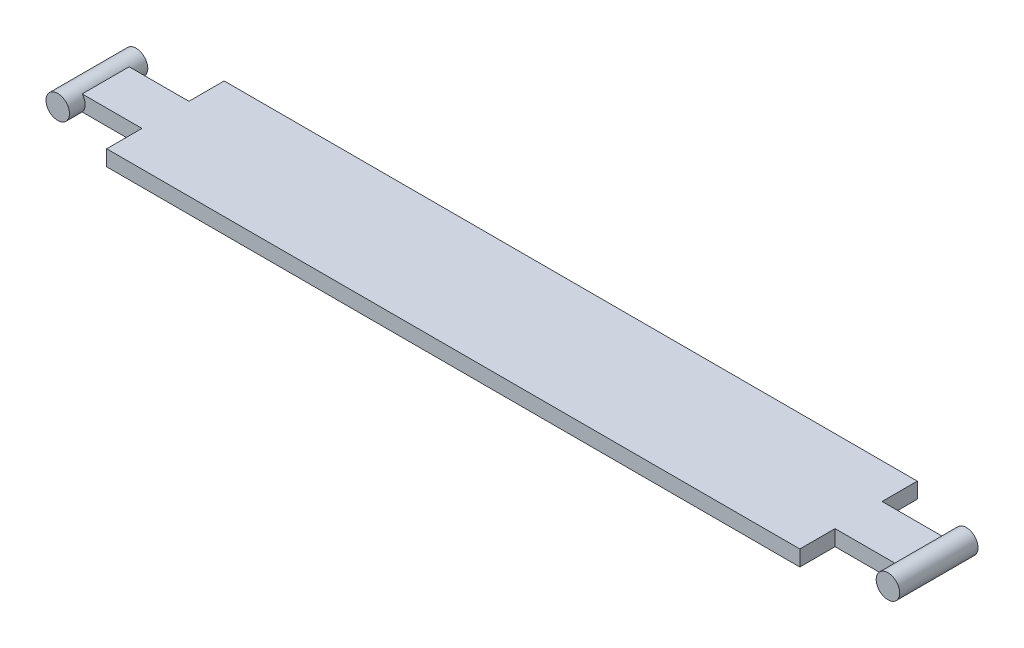
ISO-10303-21;
HEADER;
FILE_DESCRIPTION(('STEP AP214'),'2;1');
FILE_NAME('part.step','',(''),(''),'','','');
FILE_SCHEMA(('AUTOMOTIVE_DESIGN { 1 0 10303 214 1 1 1 1 }'));
ENDSEC;
DATA;
#1=APPLICATION_CONTEXT('core data for automotive mechanical design processes');
#2=APPLICATION_PROTOCOL_DEFINITION('international standard','automotive_design',2000,#1);
#3=PRODUCT_CONTEXT('',#1,'mechanical');
#4=PRODUCT('Part','Part','',(#3));
#5=PRODUCT_RELATED_PRODUCT_CATEGORY('part','',(#4));
#6=PRODUCT_DEFINITION_FORMATION('','',#4);
#7=PRODUCT_DEFINITION_CONTEXT('part definition',#1,'design');
#8=PRODUCT_DEFINITION('design','',#6,#7);
#9=PRODUCT_DEFINITION_SHAPE('','',#8);
#10=(LENGTH_UNIT() NAMED_UNIT(*) SI_UNIT(.MILLI.,.METRE.));
#11=(NAMED_UNIT(*) PLANE_ANGLE_UNIT() SI_UNIT($,.RADIAN.));
#12=(NAMED_UNIT(*) SI_UNIT($,.STERADIAN.) SOLID_ANGLE_UNIT());
#13=UNCERTAINTY_MEASURE_WITH_UNIT(LENGTH_MEASURE(1.E-05),#10,'distance_accuracy_value','');
#14=(GEOMETRIC_REPRESENTATION_CONTEXT(3) GLOBAL_UNCERTAINTY_ASSIGNED_CONTEXT((#13)) GLOBAL_UNIT_ASSIGNED_CONTEXT((#10,
#11,#12)) REPRESENTATION_CONTEXT('',''));
#15=CARTESIAN_POINT('',(0.,0.,0.));
#16=DIRECTION('',(0.,0.,1.));
#17=DIRECTION('',(1.,0.,0.));
#18=AXIS2_PLACEMENT_3D('',#15,#16,#17);
#19=CARTESIAN_POINT('',(0.,2.,0.));
#20=DIRECTION('',(0.,1.,0.));
#21=DIRECTION('',(0.,0.,1.));
#22=AXIS2_PLACEMENT_3D('',#19,#20,#21);
#23=PLANE('',#22);
#24=DIRECTION('',(1.,0.,0.));
#25=VECTOR('',#24,1.);
#26=CARTESIAN_POINT('',(53.,2.,2.99999999999999));
#27=LINE('',#26,#25);
#28=CARTESIAN_POINT('',(44.25,2.,2.99999999999999));
#29=VERTEX_POINT('',#28);
#30=CARTESIAN_POINT('',(51.8819660112501,2.,2.99999999999999));
#31=VERTEX_POINT('',#30);
#32=EDGE_CURVE('E132',#29,#31,#27,.T.);
#33=ORIENTED_EDGE('',*,*,#32,.T.);
#34=DIRECTION('',(0.,0.,-1.));
#35=VECTOR('',#34,1.);
#36=CARTESIAN_POINT('',(51.8819660112501,2.,5.));
#37=LINE('',#36,#35);
#38=CARTESIAN_POINT('',(51.8819660112501,2.,-2.99999999999999));
#39=VERTEX_POINT('',#38);
#40=EDGE_CURVE('E135',#31,#39,#37,.T.);
#41=ORIENTED_EDGE('',*,*,#40,.T.);
#42=DIRECTION('',(-1.,0.,0.));
#43=VECTOR('',#42,1.);
#44=CARTESIAN_POINT('',(53.,2.,-2.99999999999999));
#45=LINE('',#44,#43);
#46=CARTESIAN_POINT('',(44.25,2.,-2.99999999999999));
#47=VERTEX_POINT('',#46);
#48=EDGE_CURVE('E124',#39,#47,#45,.T.);
#49=ORIENTED_EDGE('',*,*,#48,.T.);
#50=DIRECTION('',(0.,0.,-1.));
#51=VECTOR('',#50,1.);
#52=CARTESIAN_POINT('',(44.25,2.,-7.49999999999999));
#53=LINE('',#52,#51);
#54=CARTESIAN_POINT('',(44.25,2.,-7.49999999999999));
#55=VERTEX_POINT('',#54);
#56=EDGE_CURVE('E131',#47,#55,#53,.T.);
#57=ORIENTED_EDGE('',*,*,#56,.T.);
#58=DIRECTION('',(-1.,0.,0.));
#59=VECTOR('',#58,1.);
#60=CARTESIAN_POINT('',(44.25,2.,-7.49999999999999));
#61=LINE('',#60,#59);
#62=CARTESIAN_POINT('',(-44.25,2.,-7.49999999999999));
#63=VERTEX_POINT('',#62);
#64=EDGE_CURVE('E168',#55,#63,#61,.T.);
#65=ORIENTED_EDGE('',*,*,#64,.T.);
#66=DIRECTION('',(0.,0.,1.));
#67=VECTOR('',#66,1.);
#68=CARTESIAN_POINT('',(-44.25,2.,-7.49999999999999));
#69=LINE('',#68,#67);
#70=CARTESIAN_POINT('',(-44.25,2.,-2.99999999999999));
#71=VERTEX_POINT('',#70);
#72=EDGE_CURVE('E170',#63,#71,#69,.T.);
#73=ORIENTED_EDGE('',*,*,#72,.T.);
#74=DIRECTION('',(-1.,0.,0.));
#75=VECTOR('',#74,1.);
#76=CARTESIAN_POINT('',(-53.,2.,-2.99999999999999));
#77=LINE('',#76,#75);
#78=CARTESIAN_POINT('',(-51.8819660112501,2.,-2.99999999999999));
#79=VERTEX_POINT('',#78);
#80=EDGE_CURVE('E172',#71,#79,#77,.T.);
#81=ORIENTED_EDGE('',*,*,#80,.T.);
#82=DIRECTION('',(0.,0.,-1.));
#83=VECTOR('',#82,1.);
#84=CARTESIAN_POINT('',(-51.8819660112501,2.,5.));
#85=LINE('',#84,#83);
#86=CARTESIAN_POINT('',(-51.8819660112501,2.,2.99999999999999));
#87=VERTEX_POINT('',#86);
#88=EDGE_CURVE('E160',#79,#87,#85,.F.);
#89=ORIENTED_EDGE('',*,*,#88,.T.);
#90=DIRECTION('',(1.,0.,0.));
#91=VECTOR('',#90,1.);
#92=CARTESIAN_POINT('',(-53.,2.,2.99999999999999));
#93=LINE('',#92,#91);
#94=CARTESIAN_POINT('',(-44.25,2.,2.99999999999999));
#95=VERTEX_POINT('',#94);
#96=EDGE_CURVE('E175',#87,#95,#93,.T.);
#97=ORIENTED_EDGE('',*,*,#96,.T.);
#98=DIRECTION('',(0.,0.,1.));
#99=VECTOR('',#98,1.);
#100=CARTESIAN_POINT('',(-44.25,2.,7.49999999999999));
#101=LINE('',#100,#99);
#102=CARTESIAN_POINT('',(-44.25,2.,7.49999999999999));
#103=VERTEX_POINT('',#102);
#104=EDGE_CURVE('E177',#95,#103,#101,.T.);
#105=ORIENTED_EDGE('',*,*,#104,.T.);
#106=DIRECTION('',(1.,0.,0.));
#107=VECTOR('',#106,1.);
#108=CARTESIAN_POINT('',(44.25,2.,7.49999999999999));
#109=LINE('',#108,#107);
#110=CARTESIAN_POINT('',(44.25,2.,7.49999999999999));
#111=VERTEX_POINT('',#110);
#112=EDGE_CURVE('E179',#103,#111,#109,.T.);
#113=ORIENTED_EDGE('',*,*,#112,.T.);
#114=DIRECTION('',(0.,0.,-1.));
#115=VECTOR('',#114,1.);
#116=CARTESIAN_POINT('',(44.25,2.,7.49999999999999));
#117=LINE('',#116,#115);
#118=EDGE_CURVE('E163',#111,#29,#117,.T.);
#119=ORIENTED_EDGE('',*,*,#118,.T.);
#120=EDGE_LOOP('',(#33,#41,#49,#57,#65,#73,#81,#89,#97,#105,#113,#119));
#121=FACE_BOUND('',#120,.T.);
#122=ADVANCED_FACE('F35',(#121),#23,.T.);
#123=CARTESIAN_POINT('',(0.,0.,0.));
#124=DIRECTION('',(0.,1.,0.));
#125=DIRECTION('',(0.,0.,1.));
#126=AXIS2_PLACEMENT_3D('',#123,#124,#125);
#127=PLANE('',#126);
#128=DIRECTION('',(0.,0.,-1.));
#129=VECTOR('',#128,1.);
#130=CARTESIAN_POINT('',(51.8819660112501,0.,5.));
#131=LINE('',#130,#129);
#132=CARTESIAN_POINT('',(51.8819660112501,0.,2.99999999999999));
#133=VERTEX_POINT('',#132);
#134=CARTESIAN_POINT('',(51.8819660112501,0.,-2.99999999999999));
#135=VERTEX_POINT('',#134);
#136=EDGE_CURVE('E58',#133,#135,#131,.T.);
#137=ORIENTED_EDGE('',*,*,#136,.F.);
#138=DIRECTION('',(1.,0.,0.));
#139=VECTOR('',#138,1.);
#140=CARTESIAN_POINT('',(53.,0.,2.99999999999999));
#141=LINE('',#140,#139);
#142=CARTESIAN_POINT('',(44.25,0.,2.99999999999999));
#143=VERTEX_POINT('',#142);
#144=EDGE_CURVE('E184',#143,#133,#141,.T.);
#145=ORIENTED_EDGE('',*,*,#144,.F.);
#146=DIRECTION('',(0.,0.,-1.));
#147=VECTOR('',#146,1.);
#148=CARTESIAN_POINT('',(44.25,0.,7.49999999999999));
#149=LINE('',#148,#147);
#150=CARTESIAN_POINT('',(44.25,0.,7.49999999999999));
#151=VERTEX_POINT('',#150);
#152=EDGE_CURVE('E162',#151,#143,#149,.T.);
#153=ORIENTED_EDGE('',*,*,#152,.F.);
#154=DIRECTION('',(1.,0.,0.));
#155=VECTOR('',#154,1.);
#156=CARTESIAN_POINT('',(44.25,0.,7.49999999999999));
#157=LINE('',#156,#155);
#158=CARTESIAN_POINT('',(-44.25,0.,7.49999999999999));
#159=VERTEX_POINT('',#158);
#160=EDGE_CURVE('E165',#159,#151,#157,.T.);
#161=ORIENTED_EDGE('',*,*,#160,.F.);
#162=DIRECTION('',(0.,0.,1.));
#163=VECTOR('',#162,1.);
#164=CARTESIAN_POINT('',(-44.25,0.,7.49999999999999));
#165=LINE('',#164,#163);
#166=CARTESIAN_POINT('',(-44.25,0.,2.99999999999999));
#167=VERTEX_POINT('',#166);
#168=EDGE_CURVE('E199',#167,#159,#165,.T.);
#169=ORIENTED_EDGE('',*,*,#168,.F.);
#170=DIRECTION('',(1.,0.,0.));
#171=VECTOR('',#170,1.);
#172=CARTESIAN_POINT('',(-53.,0.,2.99999999999999));
#173=LINE('',#172,#171);
#174=CARTESIAN_POINT('',(-51.8819660112501,0.,2.99999999999999));
#175=VERTEX_POINT('',#174);
#176=EDGE_CURVE('E197',#175,#167,#173,.T.);
#177=ORIENTED_EDGE('',*,*,#176,.F.);
#178=DIRECTION('',(0.,0.,-1.));
#179=VECTOR('',#178,1.);
#180=CARTESIAN_POINT('',(-51.8819660112501,0.,5.));
#181=LINE('',#180,#179);
#182=CARTESIAN_POINT('',(-51.8819660112501,0.,-2.99999999999999));
#183=VERTEX_POINT('',#182);
#184=EDGE_CURVE('E43',#183,#175,#181,.F.);
#185=ORIENTED_EDGE('',*,*,#184,.F.);
#186=DIRECTION('',(-1.,0.,0.));
#187=VECTOR('',#186,1.);
#188=CARTESIAN_POINT('',(-53.,0.,-2.99999999999999));
#189=LINE('',#188,#187);
#190=CARTESIAN_POINT('',(-44.25,0.,-2.99999999999999));
#191=VERTEX_POINT('',#190);
#192=EDGE_CURVE('E194',#191,#183,#189,.T.);
#193=ORIENTED_EDGE('',*,*,#192,.F.);
#194=DIRECTION('',(0.,0.,1.));
#195=VECTOR('',#194,1.);
#196=CARTESIAN_POINT('',(-44.25,0.,-7.49999999999999));
#197=LINE('',#196,#195);
#198=CARTESIAN_POINT('',(-44.25,0.,-7.49999999999999));
#199=VERTEX_POINT('',#198);
#200=EDGE_CURVE('E192',#199,#191,#197,.T.);
#201=ORIENTED_EDGE('',*,*,#200,.F.);
#202=DIRECTION('',(-1.,0.,0.));
#203=VECTOR('',#202,1.);
#204=CARTESIAN_POINT('',(44.25,0.,-7.49999999999999));
#205=LINE('',#204,#203);
#206=CARTESIAN_POINT('',(44.25,0.,-7.49999999999999));
#207=VERTEX_POINT('',#206);
#208=EDGE_CURVE('E190',#207,#199,#205,.T.);
#209=ORIENTED_EDGE('',*,*,#208,.F.);
#210=DIRECTION('',(0.,0.,-1.));
#211=VECTOR('',#210,1.);
#212=CARTESIAN_POINT('',(44.25,0.,-7.49999999999999));
#213=LINE('',#212,#211);
#214=CARTESIAN_POINT('',(44.25,0.,-2.99999999999999));
#215=VERTEX_POINT('',#214);
#216=EDGE_CURVE('E188',#215,#207,#213,.T.);
#217=ORIENTED_EDGE('',*,*,#216,.F.);
#218=DIRECTION('',(-1.,0.,0.));
#219=VECTOR('',#218,1.);
#220=CARTESIAN_POINT('',(53.,0.,-2.99999999999999));
#221=LINE('',#220,#219);
#222=EDGE_CURVE('E186',#135,#215,#221,.T.);
#223=ORIENTED_EDGE('',*,*,#222,.F.);
#224=EDGE_LOOP('',(#137,#145,#153,#161,#169,#177,#185,#193,#201,#209,#217,#223));
#225=FACE_BOUND('',#224,.T.);
#226=ADVANCED_FACE('F229',(#225),#127,.F.);
#227=CARTESIAN_POINT('',(44.25,2.,7.49999999999999));
#228=DIRECTION('',(-1.,0.,0.));
#229=DIRECTION('',(0.,0.,1.));
#230=AXIS2_PLACEMENT_3D('',#227,#228,#229);
#231=PLANE('',#230);
#232=ORIENTED_EDGE('',*,*,#152,.T.);
#233=DIRECTION('',(0.,-1.,0.));
#234=VECTOR('',#233,1.);
#235=CARTESIAN_POINT('',(44.25,2.,2.99999999999999));
#236=LINE('',#235,#234);
#237=EDGE_CURVE('E220',#29,#143,#236,.T.);
#238=ORIENTED_EDGE('',*,*,#237,.F.);
#239=ORIENTED_EDGE('',*,*,#118,.F.);
#240=DIRECTION('',(0.,-1.,0.));
#241=VECTOR('',#240,1.);
#242=CARTESIAN_POINT('',(44.25,2.,7.49999999999999));
#243=LINE('',#242,#241);
#244=EDGE_CURVE('E181',#111,#151,#243,.T.);
#245=ORIENTED_EDGE('',*,*,#244,.T.);
#246=EDGE_LOOP('',(#232,#238,#239,#245));
#247=FACE_BOUND('',#246,.T.);
#248=ADVANCED_FACE('F37',(#247),#231,.F.);
#249=CARTESIAN_POINT('',(53.,2.,2.99999999999999));
#250=DIRECTION('',(0.,0.,-1.));
#251=DIRECTION('',(-1.,0.,0.));
#252=AXIS2_PLACEMENT_3D('',#249,#250,#251);
#253=PLANE('',#252);
#254=CARTESIAN_POINT('',(53.,1.,2.99999999999999));
#255=DIRECTION('',(0.,0.,-1.));
#256=DIRECTION('',(-1.,0.,0.));
#257=AXIS2_PLACEMENT_3D('',#254,#255,#256);
#258=CIRCLE('',#257,1.5);
#259=EDGE_CURVE('E50',#31,#133,#258,.F.);
#260=ORIENTED_EDGE('',*,*,#259,.F.);
#261=ORIENTED_EDGE('',*,*,#32,.F.);
#262=ORIENTED_EDGE('',*,*,#237,.T.);
#263=ORIENTED_EDGE('',*,*,#144,.T.);
#264=EDGE_LOOP('',(#260,#261,#262,#263));
#265=FACE_BOUND('',#264,.T.);
#266=ADVANCED_FACE('F265',(#265),#253,.F.);
#267=CARTESIAN_POINT('',(53.,2.,-2.99999999999999));
#268=DIRECTION('',(0.,0.,1.));
#269=DIRECTION('',(1.,0.,0.));
#270=AXIS2_PLACEMENT_3D('',#267,#268,#269);
#271=PLANE('',#270);
#272=CARTESIAN_POINT('',(53.,1.,-2.99999999999999));
#273=DIRECTION('',(0.,0.,1.));
#274=DIRECTION('',(1.,0.,0.));
#275=AXIS2_PLACEMENT_3D('',#272,#273,#274);
#276=CIRCLE('',#275,1.5);
#277=EDGE_CURVE('E11',#135,#39,#276,.F.);
#278=ORIENTED_EDGE('',*,*,#277,.F.);
#279=ORIENTED_EDGE('',*,*,#222,.T.);
#280=DIRECTION('',(0.,-1.,0.));
#281=VECTOR('',#280,1.);
#282=CARTESIAN_POINT('',(44.25,2.,-2.99999999999999));
#283=LINE('',#282,#281);
#284=EDGE_CURVE('E128',#47,#215,#283,.T.);
#285=ORIENTED_EDGE('',*,*,#284,.F.);
#286=ORIENTED_EDGE('',*,*,#48,.F.);
#287=EDGE_LOOP('',(#278,#279,#285,#286));
#288=FACE_BOUND('',#287,.T.);
#289=ADVANCED_FACE('F126',(#288),#271,.F.);
#290=CARTESIAN_POINT('',(44.25,2.,-7.49999999999999));
#291=DIRECTION('',(-1.,0.,0.));
#292=DIRECTION('',(0.,0.,1.));
#293=AXIS2_PLACEMENT_3D('',#290,#291,#292);
#294=PLANE('',#293);
#295=ORIENTED_EDGE('',*,*,#216,.T.);
#296=DIRECTION('',(0.,-1.,0.));
#297=VECTOR('',#296,1.);
#298=CARTESIAN_POINT('',(44.25,2.,-7.49999999999999));
#299=LINE('',#298,#297);
#300=EDGE_CURVE('E216',#55,#207,#299,.T.);
#301=ORIENTED_EDGE('',*,*,#300,.F.);
#302=ORIENTED_EDGE('',*,*,#56,.F.);
#303=ORIENTED_EDGE('',*,*,#284,.T.);
#304=EDGE_LOOP('',(#295,#301,#302,#303));
#305=FACE_BOUND('',#304,.T.);
#306=ADVANCED_FACE('F247',(#305),#294,.F.);
#307=CARTESIAN_POINT('',(44.25,2.,-7.49999999999999));
#308=DIRECTION('',(0.,0.,1.));
#309=DIRECTION('',(1.,0.,0.));
#310=AXIS2_PLACEMENT_3D('',#307,#308,#309);
#311=PLANE('',#310);
#312=ORIENTED_EDGE('',*,*,#208,.T.);
#313=DIRECTION('',(0.,-1.,0.));
#314=VECTOR('',#313,1.);
#315=CARTESIAN_POINT('',(-44.25,2.,-7.49999999999999));
#316=LINE('',#315,#314);
#317=EDGE_CURVE('E213',#63,#199,#316,.T.);
#318=ORIENTED_EDGE('',*,*,#317,.F.);
#319=ORIENTED_EDGE('',*,*,#64,.F.);
#320=ORIENTED_EDGE('',*,*,#300,.T.);
#321=EDGE_LOOP('',(#312,#318,#319,#320));
#322=FACE_BOUND('',#321,.T.);
#323=ADVANCED_FACE('F243',(#322),#311,.F.);
#324=CARTESIAN_POINT('',(-44.25,2.,-7.49999999999999));
#325=DIRECTION('',(1.,0.,0.));
#326=DIRECTION('',(0.,0.,-1.));
#327=AXIS2_PLACEMENT_3D('',#324,#325,#326);
#328=PLANE('',#327);
#329=ORIENTED_EDGE('',*,*,#200,.T.);
#330=DIRECTION('',(0.,-1.,0.));
#331=VECTOR('',#330,1.);
#332=CARTESIAN_POINT('',(-44.25,2.,-2.99999999999999));
#333=LINE('',#332,#331);
#334=EDGE_CURVE('E210',#71,#191,#333,.T.);
#335=ORIENTED_EDGE('',*,*,#334,.F.);
#336=ORIENTED_EDGE('',*,*,#72,.F.);
#337=ORIENTED_EDGE('',*,*,#317,.T.);
#338=EDGE_LOOP('',(#329,#335,#336,#337));
#339=FACE_BOUND('',#338,.T.);
#340=ADVANCED_FACE('F238',(#339),#328,.F.);
#341=CARTESIAN_POINT('',(-53.,2.,-2.99999999999999));
#342=DIRECTION('',(0.,0.,1.));
#343=DIRECTION('',(1.,0.,0.));
#344=AXIS2_PLACEMENT_3D('',#341,#342,#343);
#345=PLANE('',#344);
#346=CARTESIAN_POINT('',(-53.,1.,-2.99999999999999));
#347=DIRECTION('',(0.,0.,1.));
#348=DIRECTION('',(1.,0.,0.));
#349=AXIS2_PLACEMENT_3D('',#346,#347,#348);
#350=CIRCLE('',#349,1.5);
#351=EDGE_CURVE('E157',#79,#183,#350,.F.);
#352=ORIENTED_EDGE('',*,*,#351,.F.);
#353=ORIENTED_EDGE('',*,*,#80,.F.);
#354=ORIENTED_EDGE('',*,*,#334,.T.);
#355=ORIENTED_EDGE('',*,*,#192,.T.);
#356=EDGE_LOOP('',(#352,#353,#354,#355));
#357=FACE_BOUND('',#356,.T.);
#358=ADVANCED_FACE('F233',(#357),#345,.F.);
#359=CARTESIAN_POINT('',(-53.,2.,2.99999999999999));
#360=DIRECTION('',(0.,0.,-1.));
#361=DIRECTION('',(-1.,0.,0.));
#362=AXIS2_PLACEMENT_3D('',#359,#360,#361);
#363=PLANE('',#362);
#364=CARTESIAN_POINT('',(-53.,1.,2.99999999999999));
#365=DIRECTION('',(0.,0.,-1.));
#366=DIRECTION('',(-1.,0.,0.));
#367=AXIS2_PLACEMENT_3D('',#364,#365,#366);
#368=CIRCLE('',#367,1.5);
#369=EDGE_CURVE('E152',#175,#87,#368,.F.);
#370=ORIENTED_EDGE('',*,*,#369,.F.);
#371=ORIENTED_EDGE('',*,*,#176,.T.);
#372=DIRECTION('',(0.,-1.,0.));
#373=VECTOR('',#372,1.);
#374=CARTESIAN_POINT('',(-44.25,2.,2.99999999999999));
#375=LINE('',#374,#373);
#376=EDGE_CURVE('E207',#95,#167,#375,.T.);
#377=ORIENTED_EDGE('',*,*,#376,.F.);
#378=ORIENTED_EDGE('',*,*,#96,.F.);
#379=EDGE_LOOP('',(#370,#371,#377,#378));
#380=FACE_BOUND('',#379,.T.);
#381=ADVANCED_FACE('F251',(#380),#363,.F.);
#382=CARTESIAN_POINT('',(-44.25,2.,7.49999999999999));
#383=DIRECTION('',(1.,0.,0.));
#384=DIRECTION('',(0.,0.,-1.));
#385=AXIS2_PLACEMENT_3D('',#382,#383,#384);
#386=PLANE('',#385);
#387=ORIENTED_EDGE('',*,*,#168,.T.);
#388=DIRECTION('',(0.,-1.,0.));
#389=VECTOR('',#388,1.);
#390=CARTESIAN_POINT('',(-44.25,2.,7.49999999999999));
#391=LINE('',#390,#389);
#392=EDGE_CURVE('E204',#103,#159,#391,.T.);
#393=ORIENTED_EDGE('',*,*,#392,.F.);
#394=ORIENTED_EDGE('',*,*,#104,.F.);
#395=ORIENTED_EDGE('',*,*,#376,.T.);
#396=EDGE_LOOP('',(#387,#393,#394,#395));
#397=FACE_BOUND('',#396,.T.);
#398=ADVANCED_FACE('F255',(#397),#386,.F.);
#399=CARTESIAN_POINT('',(44.25,2.,7.49999999999999));
#400=DIRECTION('',(0.,0.,-1.));
#401=DIRECTION('',(-1.,0.,0.));
#402=AXIS2_PLACEMENT_3D('',#399,#400,#401);
#403=PLANE('',#402);
#404=ORIENTED_EDGE('',*,*,#160,.T.);
#405=ORIENTED_EDGE('',*,*,#244,.F.);
#406=ORIENTED_EDGE('',*,*,#112,.F.);
#407=ORIENTED_EDGE('',*,*,#392,.T.);
#408=EDGE_LOOP('',(#404,#405,#406,#407));
#409=FACE_BOUND('',#408,.T.);
#410=ADVANCED_FACE('F261',(#409),#403,.F.);
#411=CARTESIAN_POINT('',(-53.,1.,5.));
#412=DIRECTION('',(0.,0.,-1.));
#413=DIRECTION('',(-1.,0.,0.));
#414=AXIS2_PLACEMENT_3D('',#411,#412,#413);
#415=CYLINDRICAL_SURFACE('',#414,1.5);
#416=ORIENTED_EDGE('',*,*,#88,.F.);
#417=ORIENTED_EDGE('',*,*,#351,.T.);
#418=ORIENTED_EDGE('',*,*,#184,.T.);
#419=ORIENTED_EDGE('',*,*,#369,.T.);
#420=EDGE_LOOP('',(#416,#417,#418,#419));
#421=FACE_BOUND('',#420,.T.);
#422=CARTESIAN_POINT('',(-53.,1.,5.));
#423=DIRECTION('',(0.,0.,1.));
#424=DIRECTION('',(1.,0.,0.));
#425=AXIS2_PLACEMENT_3D('',#422,#423,#424);
#426=CIRCLE('',#425,1.5);
#427=CARTESIAN_POINT('',(-51.5,1.,5.));
#428=VERTEX_POINT('',#427);
#429=EDGE_CURVE('E149',#428,#428,#426,.T.);
#430=ORIENTED_EDGE('',*,*,#429,.F.);
#431=EDGE_LOOP('',(#430));
#432=FACE_BOUND('',#431,.T.);
#433=CARTESIAN_POINT('',(-53.,1.,-5.));
#434=DIRECTION('',(0.,0.,1.));
#435=DIRECTION('',(1.,0.,0.));
#436=AXIS2_PLACEMENT_3D('',#433,#434,#435);
#437=CIRCLE('',#436,1.5);
#438=CARTESIAN_POINT('',(-51.5,1.,-5.));
#439=VERTEX_POINT('',#438);
#440=EDGE_CURVE('E148',#439,#439,#437,.T.);
#441=ORIENTED_EDGE('',*,*,#440,.T.);
#442=EDGE_LOOP('',(#441));
#443=FACE_BOUND('',#442,.T.);
#444=ADVANCED_FACE('F225',(#421,#432,#443),#415,.T.);
#445=CARTESIAN_POINT('',(-53.,1.,5.));
#446=DIRECTION('',(0.,0.,1.));
#447=DIRECTION('',(1.,0.,0.));
#448=AXIS2_PLACEMENT_3D('',#445,#446,#447);
#449=PLANE('',#448);
#450=ORIENTED_EDGE('',*,*,#429,.T.);
#451=EDGE_LOOP('',(#450));
#452=FACE_BOUND('',#451,.T.);
#453=ADVANCED_FACE('F329',(#452),#449,.T.);
#454=CARTESIAN_POINT('',(-53.,1.,-5.));
#455=DIRECTION('',(0.,0.,1.));
#456=DIRECTION('',(1.,0.,0.));
#457=AXIS2_PLACEMENT_3D('',#454,#455,#456);
#458=PLANE('',#457);
#459=ORIENTED_EDGE('',*,*,#440,.F.);
#460=EDGE_LOOP('',(#459));
#461=FACE_BOUND('',#460,.T.);
#462=ADVANCED_FACE('F335',(#461),#458,.F.);
#463=CARTESIAN_POINT('',(53.,1.,5.));
#464=DIRECTION('',(0.,0.,-1.));
#465=DIRECTION('',(-1.,0.,0.));
#466=AXIS2_PLACEMENT_3D('',#463,#464,#465);
#467=CYLINDRICAL_SURFACE('',#466,1.5);
#468=CARTESIAN_POINT('',(53.,1.,5.));
#469=DIRECTION('',(0.,0.,1.));
#470=DIRECTION('',(1.,0.,0.));
#471=AXIS2_PLACEMENT_3D('',#468,#469,#470);
#472=CIRCLE('',#471,1.5);
#473=CARTESIAN_POINT('',(54.5,1.,5.));
#474=VERTEX_POINT('',#473);
#475=EDGE_CURVE('E140',#474,#474,#472,.T.);
#476=ORIENTED_EDGE('',*,*,#475,.F.);
#477=EDGE_LOOP('',(#476));
#478=FACE_BOUND('',#477,.T.);
#479=CARTESIAN_POINT('',(53.,1.,-5.));
#480=DIRECTION('',(0.,0.,1.));
#481=DIRECTION('',(1.,0.,0.));
#482=AXIS2_PLACEMENT_3D('',#479,#480,#481);
#483=CIRCLE('',#482,1.5);
#484=CARTESIAN_POINT('',(54.5,1.,-5.));
#485=VERTEX_POINT('',#484);
#486=EDGE_CURVE('E143',#485,#485,#483,.T.);
#487=ORIENTED_EDGE('',*,*,#486,.T.);
#488=EDGE_LOOP('',(#487));
#489=FACE_BOUND('',#488,.T.);
#490=ORIENTED_EDGE('',*,*,#40,.F.);
#491=ORIENTED_EDGE('',*,*,#259,.T.);
#492=ORIENTED_EDGE('',*,*,#136,.T.);
#493=ORIENTED_EDGE('',*,*,#277,.T.);
#494=EDGE_LOOP('',(#490,#491,#492,#493));
#495=FACE_BOUND('',#494,.T.);
#496=ADVANCED_FACE('F139',(#478,#489,#495),#467,.T.);
#497=CARTESIAN_POINT('',(53.,1.,5.));
#498=DIRECTION('',(0.,0.,1.));
#499=DIRECTION('',(1.,0.,0.));
#500=AXIS2_PLACEMENT_3D('',#497,#498,#499);
#501=PLANE('',#500);
#502=ORIENTED_EDGE('',*,*,#475,.T.);
#503=EDGE_LOOP('',(#502));
#504=FACE_BOUND('',#503,.T.);
#505=ADVANCED_FACE('F349',(#504),#501,.T.);
#506=CARTESIAN_POINT('',(53.,1.,-5.));
#507=DIRECTION('',(0.,0.,1.));
#508=DIRECTION('',(1.,0.,0.));
#509=AXIS2_PLACEMENT_3D('',#506,#507,#508);
#510=PLANE('',#509);
#511=ORIENTED_EDGE('',*,*,#486,.F.);
#512=EDGE_LOOP('',(#511));
#513=FACE_BOUND('',#512,.T.);
#514=ADVANCED_FACE('F357',(#513),#510,.F.);
#515=CLOSED_SHELL('',(#122,#226,#248,#266,#289,#306,#323,#340,#358,#381,#398,#410,#444,#453,
#462,#496,#505,#514));
#516=MANIFOLD_SOLID_BREP('B2',#515);
#517=ADVANCED_BREP_SHAPE_REPRESENTATION('',(#18,#516),#14);
#518=SHAPE_DEFINITION_REPRESENTATION(#9,#517);
ENDSEC;
END-ISO-10303-21;
